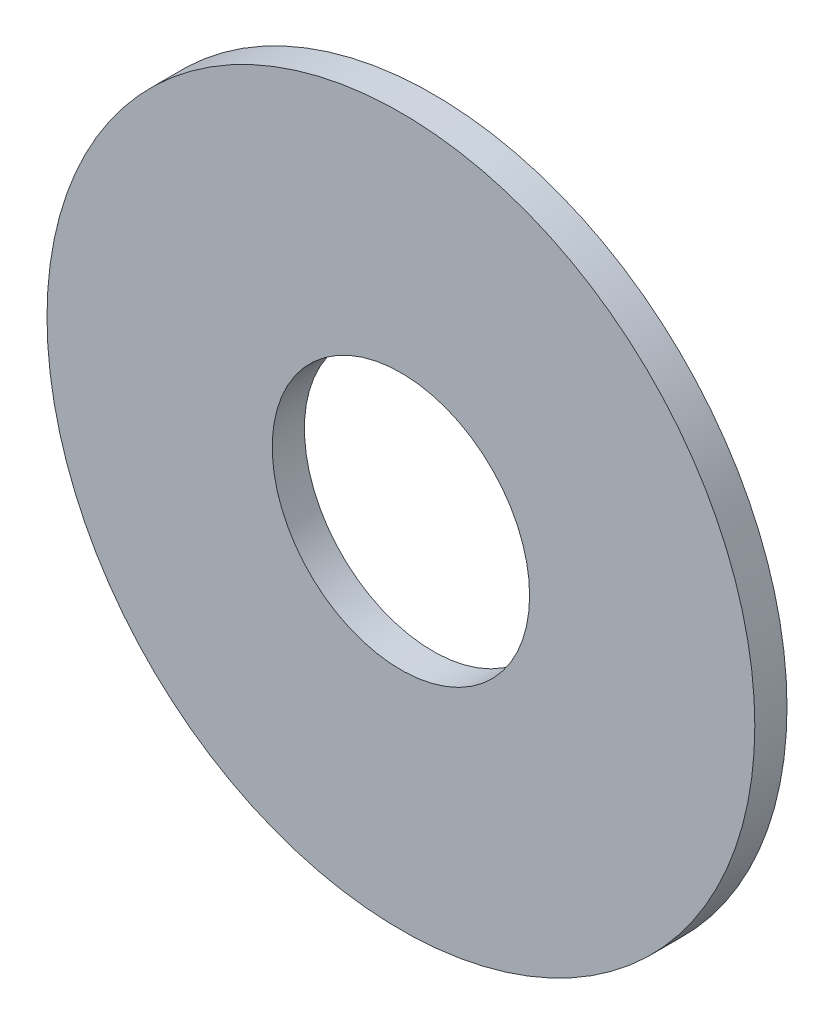
ISO-10303-21;
HEADER;
FILE_DESCRIPTION(('STEP AP214'),'2;1');
FILE_NAME('part.step','',(''),(''),'','','');
FILE_SCHEMA(('AUTOMOTIVE_DESIGN { 1 0 10303 214 1 1 1 1 }'));
ENDSEC;
DATA;
#1=APPLICATION_CONTEXT('core data for automotive mechanical design processes');
#2=APPLICATION_PROTOCOL_DEFINITION('international standard','automotive_design',2000,#1);
#3=PRODUCT_CONTEXT('',#1,'mechanical');
#4=PRODUCT('Part','Part','',(#3));
#5=PRODUCT_RELATED_PRODUCT_CATEGORY('part','',(#4));
#6=PRODUCT_DEFINITION_FORMATION('','',#4);
#7=PRODUCT_DEFINITION_CONTEXT('part definition',#1,'design');
#8=PRODUCT_DEFINITION('design','',#6,#7);
#9=PRODUCT_DEFINITION_SHAPE('','',#8);
#10=(LENGTH_UNIT() NAMED_UNIT(*) SI_UNIT(.MILLI.,.METRE.));
#11=(NAMED_UNIT(*) PLANE_ANGLE_UNIT() SI_UNIT($,.RADIAN.));
#12=(NAMED_UNIT(*) SI_UNIT($,.STERADIAN.) SOLID_ANGLE_UNIT());
#13=UNCERTAINTY_MEASURE_WITH_UNIT(LENGTH_MEASURE(1.E-05),#10,'distance_accuracy_value','');
#14=(GEOMETRIC_REPRESENTATION_CONTEXT(3) GLOBAL_UNCERTAINTY_ASSIGNED_CONTEXT((#13)) GLOBAL_UNIT_ASSIGNED_CONTEXT((#10,
#11,#12)) REPRESENTATION_CONTEXT('',''));
#15=CARTESIAN_POINT('',(0.,0.,0.));
#16=DIRECTION('',(0.,0.,1.));
#17=DIRECTION('',(1.,0.,0.));
#18=AXIS2_PLACEMENT_3D('',#15,#16,#17);
#19=CARTESIAN_POINT('',(0.,0.,0.25));
#20=DIRECTION('',(0.,0.,1.));
#21=DIRECTION('',(1.,0.,0.));
#22=AXIS2_PLACEMENT_3D('',#19,#20,#21);
#23=PLANE('',#22);
#24=CARTESIAN_POINT('',(0.,0.,0.25));
#25=DIRECTION('',(0.,0.,1.));
#26=DIRECTION('',(1.,0.,0.));
#27=AXIS2_PLACEMENT_3D('',#24,#25,#26);
#28=CIRCLE('',#27,5.5);
#29=CARTESIAN_POINT('',(5.5,0.,0.25));
#30=VERTEX_POINT('',#29);
#31=EDGE_CURVE('E10',#30,#30,#28,.T.);
#32=ORIENTED_EDGE('',*,*,#31,.T.);
#33=EDGE_LOOP('',(#32));
#34=FACE_BOUND('',#33,.T.);
#35=CARTESIAN_POINT('',(0.,0.,0.25));
#36=DIRECTION('',(0.,0.,1.));
#37=DIRECTION('',(1.,0.,0.));
#38=AXIS2_PLACEMENT_3D('',#35,#36,#37);
#39=CIRCLE('',#38,2.);
#40=CARTESIAN_POINT('',(2.,0.,0.25));
#41=VERTEX_POINT('',#40);
#42=EDGE_CURVE('E54',#41,#41,#39,.T.);
#43=ORIENTED_EDGE('',*,*,#42,.F.);
#44=EDGE_LOOP('',(#43));
#45=FACE_BOUND('',#44,.T.);
#46=ADVANCED_FACE('F40',(#34,#45),#23,.T.);
#47=CARTESIAN_POINT('',(0.,0.,-0.25));
#48=DIRECTION('',(0.,0.,1.));
#49=DIRECTION('',(1.,0.,0.));
#50=AXIS2_PLACEMENT_3D('',#47,#48,#49);
#51=PLANE('',#50);
#52=CARTESIAN_POINT('',(0.,0.,-0.25));
#53=DIRECTION('',(0.,0.,1.));
#54=DIRECTION('',(1.,0.,0.));
#55=AXIS2_PLACEMENT_3D('',#52,#53,#54);
#56=CIRCLE('',#55,5.5);
#57=CARTESIAN_POINT('',(5.5,0.,-0.25));
#58=VERTEX_POINT('',#57);
#59=EDGE_CURVE('E44',#58,#58,#56,.T.);
#60=ORIENTED_EDGE('',*,*,#59,.F.);
#61=EDGE_LOOP('',(#60));
#62=FACE_BOUND('',#61,.T.);
#63=CARTESIAN_POINT('',(0.,0.,-0.25));
#64=DIRECTION('',(0.,0.,1.));
#65=DIRECTION('',(1.,0.,0.));
#66=AXIS2_PLACEMENT_3D('',#63,#64,#65);
#67=CIRCLE('',#66,2.);
#68=CARTESIAN_POINT('',(2.,0.,-0.25));
#69=VERTEX_POINT('',#68);
#70=EDGE_CURVE('E56',#69,#69,#67,.T.);
#71=ORIENTED_EDGE('',*,*,#70,.T.);
#72=EDGE_LOOP('',(#71));
#73=FACE_BOUND('',#72,.T.);
#74=ADVANCED_FACE('F69',(#62,#73),#51,.F.);
#75=CARTESIAN_POINT('',(0.,0.,0.25));
#76=DIRECTION('',(0.,0.,-1.));
#77=DIRECTION('',(-1.,0.,0.));
#78=AXIS2_PLACEMENT_3D('',#75,#76,#77);
#79=CYLINDRICAL_SURFACE('',#78,5.5);
#80=ORIENTED_EDGE('',*,*,#31,.F.);
#81=EDGE_LOOP('',(#80));
#82=FACE_BOUND('',#81,.T.);
#83=ORIENTED_EDGE('',*,*,#59,.T.);
#84=EDGE_LOOP('',(#83));
#85=FACE_BOUND('',#84,.T.);
#86=ADVANCED_FACE('F42',(#82,#85),#79,.T.);
#87=CARTESIAN_POINT('',(0.,0.,0.25));
#88=DIRECTION('',(0.,0.,-1.));
#89=DIRECTION('',(-1.,0.,0.));
#90=AXIS2_PLACEMENT_3D('',#87,#88,#89);
#91=CYLINDRICAL_SURFACE('',#90,2.);
#92=ORIENTED_EDGE('',*,*,#42,.T.);
#93=EDGE_LOOP('',(#92));
#94=FACE_BOUND('',#93,.T.);
#95=ORIENTED_EDGE('',*,*,#70,.F.);
#96=EDGE_LOOP('',(#95));
#97=FACE_BOUND('',#96,.T.);
#98=ADVANCED_FACE('F65',(#94,#97),#91,.F.);
#99=CLOSED_SHELL('',(#46,#74,#86,#98));
#100=MANIFOLD_SOLID_BREP('B2',#99);
#101=ADVANCED_BREP_SHAPE_REPRESENTATION('',(#18,#100),#14);
#102=SHAPE_DEFINITION_REPRESENTATION(#9,#101);
ENDSEC;
END-ISO-10303-21;
